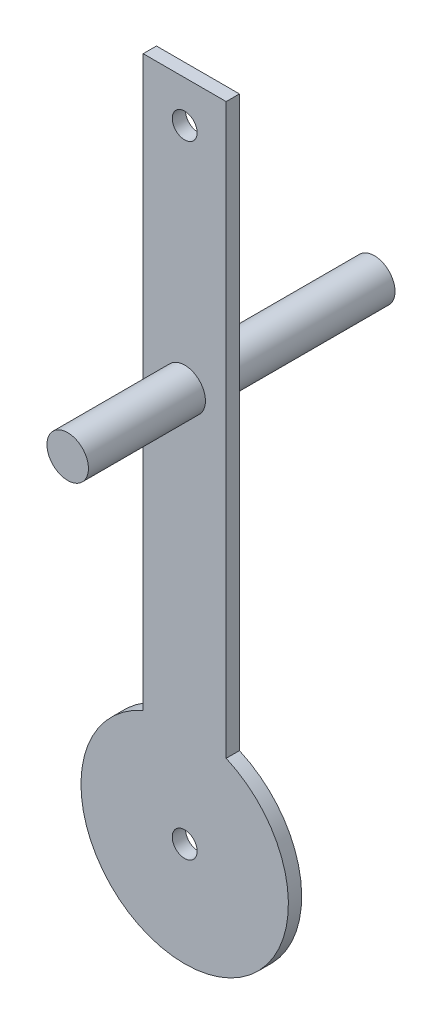
ISO-10303-21;
HEADER;
FILE_DESCRIPTION(('STEP AP214'),'2;1');
FILE_NAME('part.step','',(''),(''),'','','');
FILE_SCHEMA(('AUTOMOTIVE_DESIGN { 1 0 10303 214 1 1 1 1 }'));
ENDSEC;
DATA;
#1=APPLICATION_CONTEXT('core data for automotive mechanical design processes');
#2=APPLICATION_PROTOCOL_DEFINITION('international standard','automotive_design',2000,#1);
#3=PRODUCT_CONTEXT('',#1,'mechanical');
#4=PRODUCT('Part','Part','',(#3));
#5=PRODUCT_RELATED_PRODUCT_CATEGORY('part','',(#4));
#6=PRODUCT_DEFINITION_FORMATION('','',#4);
#7=PRODUCT_DEFINITION_CONTEXT('part definition',#1,'design');
#8=PRODUCT_DEFINITION('design','',#6,#7);
#9=PRODUCT_DEFINITION_SHAPE('','',#8);
#10=(LENGTH_UNIT() NAMED_UNIT(*) SI_UNIT(.MILLI.,.METRE.));
#11=(NAMED_UNIT(*) PLANE_ANGLE_UNIT() SI_UNIT($,.RADIAN.));
#12=(NAMED_UNIT(*) SI_UNIT($,.STERADIAN.) SOLID_ANGLE_UNIT());
#13=UNCERTAINTY_MEASURE_WITH_UNIT(LENGTH_MEASURE(1.E-05),#10,'distance_accuracy_value','');
#14=(GEOMETRIC_REPRESENTATION_CONTEXT(3) GLOBAL_UNCERTAINTY_ASSIGNED_CONTEXT((#13)) GLOBAL_UNIT_ASSIGNED_CONTEXT((#10,
#11,#12)) REPRESENTATION_CONTEXT('',''));
#15=CARTESIAN_POINT('',(0.,0.,0.));
#16=DIRECTION('',(0.,0.,1.));
#17=DIRECTION('',(1.,0.,0.));
#18=AXIS2_PLACEMENT_3D('',#15,#16,#17);
#19=CARTESIAN_POINT('',(5.,-11.4564392373896,1.6));
#20=DIRECTION('',(0.,0.,1.));
#21=DIRECTION('',(1.,0.,0.));
#22=AXIS2_PLACEMENT_3D('',#19,#20,#21);
#23=PLANE('',#22);
#24=CARTESIAN_POINT('',(5.,36.0435607626104,1.6));
#25=DIRECTION('',(0.,0.,1.));
#26=DIRECTION('',(1.,0.,0.));
#27=AXIS2_PLACEMENT_3D('',#24,#25,#26);
#28=CIRCLE('',#27,2.5);
#29=CARTESIAN_POINT('',(7.5,36.0435607626104,1.6));
#30=VERTEX_POINT('',#29);
#31=EDGE_CURVE('E132',#30,#30,#28,.T.);
#32=ORIENTED_EDGE('',*,*,#31,.F.);
#33=EDGE_LOOP('',(#32));
#34=FACE_BOUND('',#33,.T.);
#35=CARTESIAN_POINT('',(5.,63.5435607626104,1.6));
#36=DIRECTION('',(0.,0.,1.));
#37=DIRECTION('',(1.,0.,0.));
#38=AXIS2_PLACEMENT_3D('',#35,#36,#37);
#39=CIRCLE('',#38,1.5);
#40=CARTESIAN_POINT('',(6.5,63.5435607626104,1.6));
#41=VERTEX_POINT('',#40);
#42=EDGE_CURVE('E126',#41,#41,#39,.T.);
#43=ORIENTED_EDGE('',*,*,#42,.F.);
#44=EDGE_LOOP('',(#43));
#45=FACE_BOUND('',#44,.T.);
#46=CARTESIAN_POINT('',(5.,-11.4564392373896,1.6));
#47=DIRECTION('',(0.,0.,1.));
#48=DIRECTION('',(1.,0.,0.));
#49=AXIS2_PLACEMENT_3D('',#46,#47,#48);
#50=CIRCLE('',#49,12.5);
#51=CARTESIAN_POINT('',(0.,0.,1.6));
#52=VERTEX_POINT('',#51);
#53=CARTESIAN_POINT('',(10.,0.,1.6));
#54=VERTEX_POINT('',#53);
#55=EDGE_CURVE('E87',#52,#54,#50,.T.);
#56=ORIENTED_EDGE('',*,*,#55,.T.);
#57=DIRECTION('',(0.,1.,0.));
#58=VECTOR('',#57,1.);
#59=CARTESIAN_POINT('',(10.,0.,1.6));
#60=LINE('',#59,#58);
#61=CARTESIAN_POINT('',(10.,68.5435607626104,1.6));
#62=VERTEX_POINT('',#61);
#63=EDGE_CURVE('E82',#54,#62,#60,.T.);
#64=ORIENTED_EDGE('',*,*,#63,.T.);
#65=DIRECTION('',(-1.,0.,0.));
#66=VECTOR('',#65,1.);
#67=CARTESIAN_POINT('',(0.,68.5435607626104,1.6));
#68=LINE('',#67,#66);
#69=CARTESIAN_POINT('',(0.,68.5435607626104,1.6));
#70=VERTEX_POINT('',#69);
#71=EDGE_CURVE('E85',#62,#70,#68,.T.);
#72=ORIENTED_EDGE('',*,*,#71,.T.);
#73=DIRECTION('',(0.,-1.,0.));
#74=VECTOR('',#73,1.);
#75=CARTESIAN_POINT('',(0.,0.,1.6));
#76=LINE('',#75,#74);
#77=EDGE_CURVE('E51',#70,#52,#76,.T.);
#78=ORIENTED_EDGE('',*,*,#77,.T.);
#79=EDGE_LOOP('',(#56,#64,#72,#78));
#80=FACE_BOUND('',#79,.T.);
#81=CARTESIAN_POINT('',(5.,-11.4564392373896,1.6));
#82=DIRECTION('',(0.,0.,1.));
#83=DIRECTION('',(1.,0.,0.));
#84=AXIS2_PLACEMENT_3D('',#81,#82,#83);
#85=CIRCLE('',#84,1.5);
#86=CARTESIAN_POINT('',(6.5,-11.4564392373896,1.6));
#87=VERTEX_POINT('',#86);
#88=EDGE_CURVE('E104',#87,#87,#85,.T.);
#89=ORIENTED_EDGE('',*,*,#88,.F.);
#90=EDGE_LOOP('',(#89));
#91=FACE_BOUND('',#90,.T.);
#92=ADVANCED_FACE('F34',(#34,#45,#80,#91),#23,.T.);
#93=CARTESIAN_POINT('',(5.,-11.4564392373896,0.));
#94=DIRECTION('',(0.,0.,1.));
#95=DIRECTION('',(1.,0.,0.));
#96=AXIS2_PLACEMENT_3D('',#93,#94,#95);
#97=PLANE('',#96);
#98=CARTESIAN_POINT('',(5.,36.0435607626104,0.));
#99=DIRECTION('',(0.,0.,1.));
#100=DIRECTION('',(1.,0.,0.));
#101=AXIS2_PLACEMENT_3D('',#98,#99,#100);
#102=CIRCLE('',#101,2.5);
#103=CARTESIAN_POINT('',(7.5,36.0435607626104,0.));
#104=VERTEX_POINT('',#103);
#105=EDGE_CURVE('E11',#104,#104,#102,.F.);
#106=ORIENTED_EDGE('',*,*,#105,.F.);
#107=EDGE_LOOP('',(#106));
#108=FACE_BOUND('',#107,.T.);
#109=CARTESIAN_POINT('',(5.,63.5435607626104,0.));
#110=DIRECTION('',(0.,0.,1.));
#111=DIRECTION('',(1.,0.,0.));
#112=AXIS2_PLACEMENT_3D('',#109,#110,#111);
#113=CIRCLE('',#112,1.5);
#114=CARTESIAN_POINT('',(6.5,63.5435607626104,0.));
#115=VERTEX_POINT('',#114);
#116=EDGE_CURVE('E121',#115,#115,#113,.T.);
#117=ORIENTED_EDGE('',*,*,#116,.T.);
#118=EDGE_LOOP('',(#117));
#119=FACE_BOUND('',#118,.T.);
#120=CARTESIAN_POINT('',(5.,-11.4564392373896,0.));
#121=DIRECTION('',(0.,0.,1.));
#122=DIRECTION('',(1.,0.,0.));
#123=AXIS2_PLACEMENT_3D('',#120,#121,#122);
#124=CIRCLE('',#123,12.5);
#125=CARTESIAN_POINT('',(0.,0.,0.));
#126=VERTEX_POINT('',#125);
#127=CARTESIAN_POINT('',(10.,0.,0.));
#128=VERTEX_POINT('',#127);
#129=EDGE_CURVE('E101',#126,#128,#124,.T.);
#130=ORIENTED_EDGE('',*,*,#129,.F.);
#131=DIRECTION('',(0.,-1.,0.));
#132=VECTOR('',#131,1.);
#133=CARTESIAN_POINT('',(0.,0.,0.));
#134=LINE('',#133,#132);
#135=CARTESIAN_POINT('',(0.,68.5435607626104,0.));
#136=VERTEX_POINT('',#135);
#137=EDGE_CURVE('E74',#136,#126,#134,.T.);
#138=ORIENTED_EDGE('',*,*,#137,.F.);
#139=DIRECTION('',(-1.,0.,0.));
#140=VECTOR('',#139,1.);
#141=CARTESIAN_POINT('',(0.,68.5435607626104,0.));
#142=LINE('',#141,#140);
#143=CARTESIAN_POINT('',(10.,68.5435607626104,0.));
#144=VERTEX_POINT('',#143);
#145=EDGE_CURVE('E68',#144,#136,#142,.T.);
#146=ORIENTED_EDGE('',*,*,#145,.F.);
#147=DIRECTION('',(0.,1.,0.));
#148=VECTOR('',#147,1.);
#149=CARTESIAN_POINT('',(10.,0.,0.));
#150=LINE('',#149,#148);
#151=EDGE_CURVE('E92',#128,#144,#150,.T.);
#152=ORIENTED_EDGE('',*,*,#151,.F.);
#153=EDGE_LOOP('',(#130,#138,#146,#152));
#154=FACE_BOUND('',#153,.T.);
#155=CARTESIAN_POINT('',(5.,-11.4564392373896,0.));
#156=DIRECTION('',(0.,0.,1.));
#157=DIRECTION('',(1.,0.,0.));
#158=AXIS2_PLACEMENT_3D('',#155,#156,#157);
#159=CIRCLE('',#158,1.5);
#160=CARTESIAN_POINT('',(6.5,-11.4564392373896,0.));
#161=VERTEX_POINT('',#160);
#162=EDGE_CURVE('E119',#161,#161,#159,.T.);
#163=ORIENTED_EDGE('',*,*,#162,.T.);
#164=EDGE_LOOP('',(#163));
#165=FACE_BOUND('',#164,.T.);
#166=ADVANCED_FACE('F112',(#108,#119,#154,#165),#97,.F.);
#167=CARTESIAN_POINT('',(5.,-11.4564392373896,1.6));
#168=DIRECTION('',(0.,0.,-1.));
#169=DIRECTION('',(-1.,0.,0.));
#170=AXIS2_PLACEMENT_3D('',#167,#168,#169);
#171=CYLINDRICAL_SURFACE('',#170,12.5);
#172=ORIENTED_EDGE('',*,*,#129,.T.);
#173=DIRECTION('',(0.,0.,-1.));
#174=VECTOR('',#173,1.);
#175=CARTESIAN_POINT('',(10.,0.,1.6));
#176=LINE('',#175,#174);
#177=EDGE_CURVE('E43',#54,#128,#176,.T.);
#178=ORIENTED_EDGE('',*,*,#177,.F.);
#179=ORIENTED_EDGE('',*,*,#55,.F.);
#180=DIRECTION('',(0.,0.,-1.));
#181=VECTOR('',#180,1.);
#182=CARTESIAN_POINT('',(0.,0.,1.6));
#183=LINE('',#182,#181);
#184=EDGE_CURVE('E97',#52,#126,#183,.T.);
#185=ORIENTED_EDGE('',*,*,#184,.T.);
#186=EDGE_LOOP('',(#172,#178,#179,#185));
#187=FACE_BOUND('',#186,.T.);
#188=ADVANCED_FACE('F36',(#187),#171,.T.);
#189=CARTESIAN_POINT('',(10.,0.,1.6));
#190=DIRECTION('',(-1.,0.,0.));
#191=DIRECTION('',(0.,-1.,0.));
#192=AXIS2_PLACEMENT_3D('',#189,#190,#191);
#193=PLANE('',#192);
#194=ORIENTED_EDGE('',*,*,#151,.T.);
#195=DIRECTION('',(0.,0.,-1.));
#196=VECTOR('',#195,1.);
#197=CARTESIAN_POINT('',(10.,68.5435607626104,1.6));
#198=LINE('',#197,#196);
#199=EDGE_CURVE('E90',#62,#144,#198,.T.);
#200=ORIENTED_EDGE('',*,*,#199,.F.);
#201=ORIENTED_EDGE('',*,*,#63,.F.);
#202=ORIENTED_EDGE('',*,*,#177,.T.);
#203=EDGE_LOOP('',(#194,#200,#201,#202));
#204=FACE_BOUND('',#203,.T.);
#205=ADVANCED_FACE('F91',(#204),#193,.F.);
#206=CARTESIAN_POINT('',(0.,68.5435607626104,1.6));
#207=DIRECTION('',(0.,-1.,0.));
#208=DIRECTION('',(0.,0.,-1.));
#209=AXIS2_PLACEMENT_3D('',#206,#207,#208);
#210=PLANE('',#209);
#211=ORIENTED_EDGE('',*,*,#145,.T.);
#212=DIRECTION('',(0.,0.,-1.));
#213=VECTOR('',#212,1.);
#214=CARTESIAN_POINT('',(0.,68.5435607626104,1.6));
#215=LINE('',#214,#213);
#216=EDGE_CURVE('E93',#70,#136,#215,.T.);
#217=ORIENTED_EDGE('',*,*,#216,.F.);
#218=ORIENTED_EDGE('',*,*,#71,.F.);
#219=ORIENTED_EDGE('',*,*,#199,.T.);
#220=EDGE_LOOP('',(#211,#217,#218,#219));
#221=FACE_BOUND('',#220,.T.);
#222=ADVANCED_FACE('F95',(#221),#210,.F.);
#223=CARTESIAN_POINT('',(0.,0.,1.6));
#224=DIRECTION('',(1.,0.,0.));
#225=DIRECTION('',(0.,0.,-1.));
#226=AXIS2_PLACEMENT_3D('',#223,#224,#225);
#227=PLANE('',#226);
#228=ORIENTED_EDGE('',*,*,#137,.T.);
#229=ORIENTED_EDGE('',*,*,#184,.F.);
#230=ORIENTED_EDGE('',*,*,#77,.F.);
#231=ORIENTED_EDGE('',*,*,#216,.T.);
#232=EDGE_LOOP('',(#228,#229,#230,#231));
#233=FACE_BOUND('',#232,.T.);
#234=ADVANCED_FACE('F168',(#233),#227,.F.);
#235=CARTESIAN_POINT('',(5.,-11.4564392373896,1.6));
#236=DIRECTION('',(0.,0.,-1.));
#237=DIRECTION('',(-1.,0.,0.));
#238=AXIS2_PLACEMENT_3D('',#235,#236,#237);
#239=CYLINDRICAL_SURFACE('',#238,1.5);
#240=ORIENTED_EDGE('',*,*,#88,.T.);
#241=EDGE_LOOP('',(#240));
#242=FACE_BOUND('',#241,.T.);
#243=ORIENTED_EDGE('',*,*,#162,.F.);
#244=EDGE_LOOP('',(#243));
#245=FACE_BOUND('',#244,.T.);
#246=ADVANCED_FACE('F156',(#242,#245),#239,.F.);
#247=CARTESIAN_POINT('',(5.,63.5435607626104,0.));
#248=DIRECTION('',(0.,0.,1.));
#249=DIRECTION('',(1.,0.,0.));
#250=AXIS2_PLACEMENT_3D('',#247,#248,#249);
#251=CYLINDRICAL_SURFACE('',#250,1.5);
#252=ORIENTED_EDGE('',*,*,#116,.F.);
#253=EDGE_LOOP('',(#252));
#254=FACE_BOUND('',#253,.T.);
#255=ORIENTED_EDGE('',*,*,#42,.T.);
#256=EDGE_LOOP('',(#255));
#257=FACE_BOUND('',#256,.T.);
#258=ADVANCED_FACE('F152',(#254,#257),#251,.F.);
#259=CARTESIAN_POINT('',(5.,36.0435607626104,15.7));
#260=DIRECTION('',(0.,0.,-1.));
#261=DIRECTION('',(-1.,0.,0.));
#262=AXIS2_PLACEMENT_3D('',#259,#260,#261);
#263=CYLINDRICAL_SURFACE('',#262,2.5);
#264=CARTESIAN_POINT('',(5.,36.0435607626104,15.7));
#265=DIRECTION('',(0.,0.,1.));
#266=DIRECTION('',(1.,0.,0.));
#267=AXIS2_PLACEMENT_3D('',#264,#265,#266);
#268=CIRCLE('',#267,2.5);
#269=CARTESIAN_POINT('',(7.5,36.0435607626104,15.7));
#270=VERTEX_POINT('',#269);
#271=EDGE_CURVE('E130',#270,#270,#268,.T.);
#272=ORIENTED_EDGE('',*,*,#271,.F.);
#273=EDGE_LOOP('',(#272));
#274=FACE_BOUND('',#273,.T.);
#275=ORIENTED_EDGE('',*,*,#31,.T.);
#276=EDGE_LOOP('',(#275));
#277=FACE_BOUND('',#276,.T.);
#278=ADVANCED_FACE('F155',(#274,#277),#263,.T.);
#279=CARTESIAN_POINT('',(5.,36.0435607626104,15.7));
#280=DIRECTION('',(0.,0.,1.));
#281=DIRECTION('',(1.,0.,0.));
#282=AXIS2_PLACEMENT_3D('',#279,#280,#281);
#283=PLANE('',#282);
#284=ORIENTED_EDGE('',*,*,#271,.T.);
#285=EDGE_LOOP('',(#284));
#286=FACE_BOUND('',#285,.T.);
#287=ADVANCED_FACE('F146',(#286),#283,.T.);
#288=CARTESIAN_POINT('',(5.,36.0435607626104,-21.25));
#289=DIRECTION('',(0.,0.,1.));
#290=DIRECTION('',(1.,0.,0.));
#291=AXIS2_PLACEMENT_3D('',#288,#289,#290);
#292=CYLINDRICAL_SURFACE('',#291,2.5);
#293=CARTESIAN_POINT('',(5.,36.0435607626104,-21.25));
#294=DIRECTION('',(0.,0.,-1.));
#295=DIRECTION('',(-1.,0.,0.));
#296=AXIS2_PLACEMENT_3D('',#293,#294,#295);
#297=CIRCLE('',#296,2.5);
#298=CARTESIAN_POINT('',(2.5,36.0435607626104,-21.25));
#299=VERTEX_POINT('',#298);
#300=EDGE_CURVE('E135',#299,#299,#297,.T.);
#301=ORIENTED_EDGE('',*,*,#300,.F.);
#302=EDGE_LOOP('',(#301));
#303=FACE_BOUND('',#302,.T.);
#304=ORIENTED_EDGE('',*,*,#105,.T.);
#305=EDGE_LOOP('',(#304));
#306=FACE_BOUND('',#305,.T.);
#307=ADVANCED_FACE('F143',(#303,#306),#292,.T.);
#308=CARTESIAN_POINT('',(5.,36.0435607626104,-21.25));
#309=DIRECTION('',(0.,0.,-1.));
#310=DIRECTION('',(-1.,0.,0.));
#311=AXIS2_PLACEMENT_3D('',#308,#309,#310);
#312=PLANE('',#311);
#313=ORIENTED_EDGE('',*,*,#300,.T.);
#314=EDGE_LOOP('',(#313));
#315=FACE_BOUND('',#314,.T.);
#316=ADVANCED_FACE('F141',(#315),#312,.T.);
#317=CLOSED_SHELL('',(#92,#166,#188,#205,#222,#234,#246,#258,#278,#287,#307,#316));
#318=MANIFOLD_SOLID_BREP('B2',#317);
#319=ADVANCED_BREP_SHAPE_REPRESENTATION('',(#18,#318),#14);
#320=SHAPE_DEFINITION_REPRESENTATION(#9,#319);
ENDSEC;
END-ISO-10303-21;
